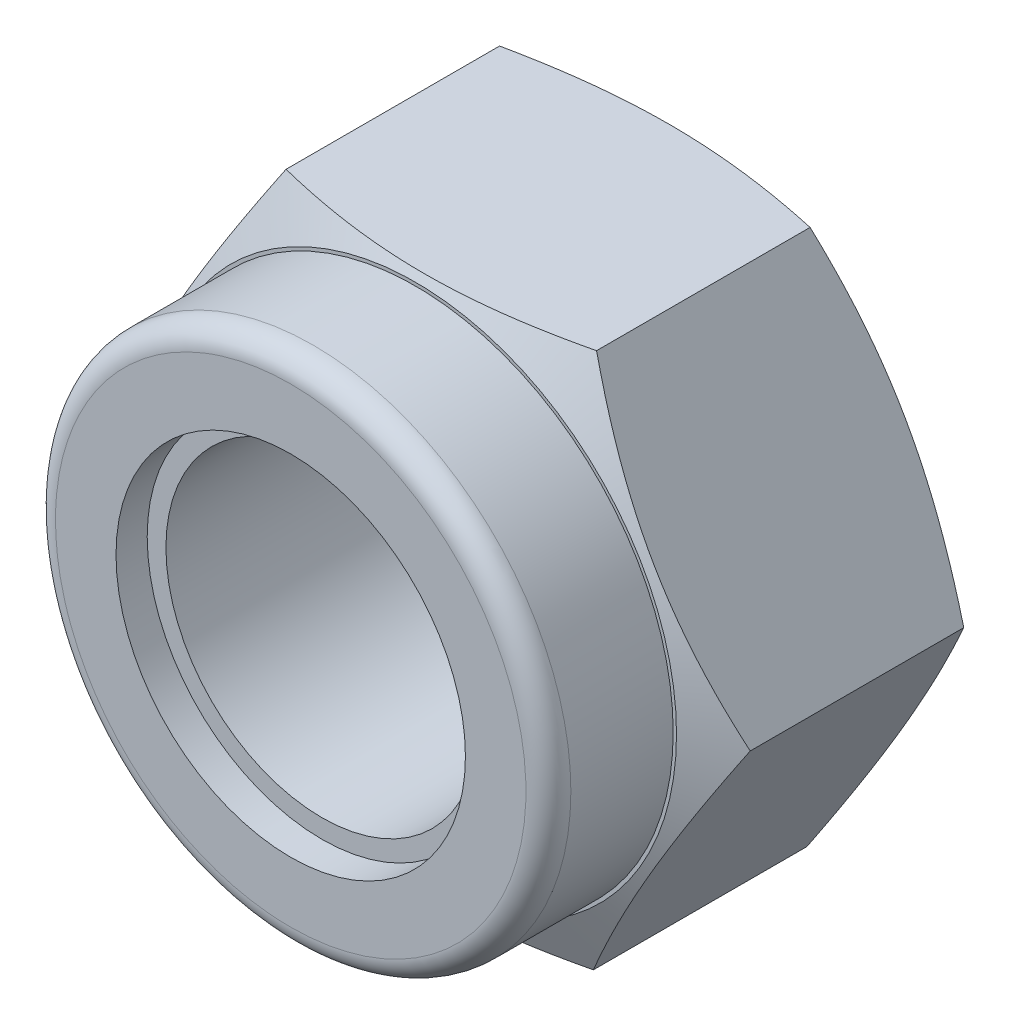
ISO-10303-21;
HEADER;
FILE_DESCRIPTION(('STEP AP214'),'2;1');
FILE_NAME('part.step','',(''),(''),'','','');
FILE_SCHEMA(('AUTOMOTIVE_DESIGN { 1 0 10303 214 1 1 1 1 }'));
ENDSEC;
DATA;
#1=APPLICATION_CONTEXT('core data for automotive mechanical design processes');
#2=APPLICATION_PROTOCOL_DEFINITION('international standard','automotive_design',2000,#1);
#3=PRODUCT_CONTEXT('',#1,'mechanical');
#4=PRODUCT('Part','Part','',(#3));
#5=PRODUCT_RELATED_PRODUCT_CATEGORY('part','',(#4));
#6=PRODUCT_DEFINITION_FORMATION('','',#4);
#7=PRODUCT_DEFINITION_CONTEXT('part definition',#1,'design');
#8=PRODUCT_DEFINITION('design','',#6,#7);
#9=PRODUCT_DEFINITION_SHAPE('','',#8);
#10=(LENGTH_UNIT() NAMED_UNIT(*) SI_UNIT(.MILLI.,.METRE.));
#11=(NAMED_UNIT(*) PLANE_ANGLE_UNIT() SI_UNIT($,.RADIAN.));
#12=(NAMED_UNIT(*) SI_UNIT($,.STERADIAN.) SOLID_ANGLE_UNIT());
#13=UNCERTAINTY_MEASURE_WITH_UNIT(LENGTH_MEASURE(1.E-05),#10,'distance_accuracy_value','');
#14=(GEOMETRIC_REPRESENTATION_CONTEXT(3) GLOBAL_UNCERTAINTY_ASSIGNED_CONTEXT((#13)) GLOBAL_UNIT_ASSIGNED_CONTEXT((#10,
#11,#12)) REPRESENTATION_CONTEXT('',''));
#15=CARTESIAN_POINT('',(0.,0.,0.));
#16=DIRECTION('',(0.,0.,1.));
#17=DIRECTION('',(1.,0.,0.));
#18=AXIS2_PLACEMENT_3D('',#15,#16,#17);
#19=CARTESIAN_POINT('',(0.,0.,5.334));
#20=DIRECTION('',(0.,0.,1.));
#21=DIRECTION('',(1.,0.,0.));
#22=AXIS2_PLACEMENT_3D('',#19,#20,#21);
#23=PLANE('',#22);
#24=CARTESIAN_POINT('',(0.,0.,5.33400000000736));
#25=DIRECTION('',(0.,0.,-1.));
#26=DIRECTION('',(-1.,0.,0.));
#27=AXIS2_PLACEMENT_3D('',#24,#25,#26);
#28=CIRCLE('',#27,5.31273775635555);
#29=CARTESIAN_POINT('',(-5.31273775635555,0.,5.33400000000736));
#30=VERTEX_POINT('',#29);
#31=EDGE_CURVE('E293',#30,#30,#28,.T.);
#32=ORIENTED_EDGE('',*,*,#31,.F.);
#33=EDGE_LOOP('',(#32));
#34=FACE_BOUND('',#33,.T.);
#35=CARTESIAN_POINT('',(0.,0.,5.334));
#36=DIRECTION('',(0.,0.,1.));
#37=DIRECTION('',(1.,0.,0.));
#38=AXIS2_PLACEMENT_3D('',#35,#36,#37);
#39=CIRCLE('',#38,5.2451);
#40=CARTESIAN_POINT('',(5.2451,0.,5.334));
#41=VERTEX_POINT('',#40);
#42=EDGE_CURVE('E20',#41,#41,#39,.T.);
#43=ORIENTED_EDGE('',*,*,#42,.F.);
#44=EDGE_LOOP('',(#43));
#45=FACE_BOUND('',#44,.T.);
#46=ADVANCED_FACE('F16',(#34,#45),#23,.T.);
#47=CARTESIAN_POINT('',(0.,0.,5.334));
#48=DIRECTION('',(0.,0.,1.));
#49=DIRECTION('',(1.,0.,0.));
#50=AXIS2_PLACEMENT_3D('',#47,#48,#49);
#51=CYLINDRICAL_SURFACE('',#50,5.2451);
#52=ORIENTED_EDGE('',*,*,#42,.T.);
#53=EDGE_LOOP('',(#52));
#54=FACE_BOUND('',#53,.T.);
#55=CARTESIAN_POINT('',(0.,0.,7.4168));
#56=DIRECTION('',(0.,0.,1.));
#57=DIRECTION('',(1.,0.,0.));
#58=AXIS2_PLACEMENT_3D('',#55,#56,#57);
#59=CIRCLE('',#58,5.2451);
#60=CARTESIAN_POINT('',(5.2451,0.,7.4168));
#61=VERTEX_POINT('',#60);
#62=EDGE_CURVE('E85',#61,#61,#59,.T.);
#63=ORIENTED_EDGE('',*,*,#62,.F.);
#64=EDGE_LOOP('',(#63));
#65=FACE_BOUND('',#64,.T.);
#66=ADVANCED_FACE('F121',(#54,#65),#51,.T.);
#67=CARTESIAN_POINT('',(0.,0.,4.83836780344404));
#68=DIRECTION('',(0.,0.,-1.));
#69=DIRECTION('',(-1.,0.,0.));
#70=AXIS2_PLACEMENT_3D('',#67,#68,#69);
#71=CONICAL_SURFACE('',#70,6.3265308160112,1.11607702485432);
#72=CARTESIAN_POINT('',(6.32037506594794,-0.0371655629206129,4.84132386008899));
#73=CARTESIAN_POINT('',(6.22833366151809,-0.19444286281713,4.8858660135372));
#74=CARTESIAN_POINT('',(6.13593989417938,-0.352322268768321,4.92769627799901));
#75=CARTESIAN_POINT('',(5.95043037166558,-0.669314789545201,5.00501655106751));
#76=CARTESIAN_POINT('',(5.85731426499188,-0.828428505000025,5.04050324073664));
#77=CARTESIAN_POINT('',(5.67031652629657,-1.14796404024023,5.10421314817306));
#78=CARTESIAN_POINT('',(5.57643405141017,-1.30838730028498,5.1324267923882));
#79=CARTESIAN_POINT('',(5.38814286869859,-1.63013302977098,5.18062149325364));
#80=CARTESIAN_POINT('',(5.29373425705883,-1.79145533485376,5.20060400767163));
#81=CARTESIAN_POINT('',(5.10662322282933,-2.11118446574603,5.23126731054475));
#82=CARTESIAN_POINT('',(5.01392905247022,-2.26957719041745,5.24214339050006));
#83=CARTESIAN_POINT('',(4.82837594477426,-2.58664418810835,5.25490604687276));
#84=CARTESIAN_POINT('',(4.73551699905818,-2.74531847544599,5.25679215221227));
#85=CARTESIAN_POINT('',(4.54996186341723,-3.06238893842205,5.25150045578435));
#86=CARTESIAN_POINT('',(4.4572656043928,-3.2207852321355,5.24433199570822));
#87=CARTESIAN_POINT('',(4.27216288236742,-3.53708262572682,5.22123078858181));
#88=CARTESIAN_POINT('',(4.17975639476994,-3.69498376763441,5.20529880682979));
#89=CARTESIAN_POINT('',(4.00714250371091,-3.98994066098654,5.16780955551947));
#90=CARTESIAN_POINT('',(3.92688014289494,-4.12709032173596,5.14722700506324));
#91=CARTESIAN_POINT('',(3.76677978044193,-4.40066451234116,5.10035283174324));
#92=CARTESIAN_POINT('',(3.68694180089308,-4.53708900445337,5.0740609146422));
#93=CARTESIAN_POINT('',(3.5269404443261,-4.81049401708344,5.01605322972002));
#94=CARTESIAN_POINT('',(3.44678193376816,-4.94746622195552,4.9842853299852));
#95=CARTESIAN_POINT('',(3.28699660715654,-5.22050208976119,4.91612438552128));
#96=CARTESIAN_POINT('',(3.20736961164292,-5.35656605935,4.87973299465746));
#97=CARTESIAN_POINT('',(3.12800121134054,-5.49218815001656,4.84132386008874));
#98=B_SPLINE_CURVE_WITH_KNOTS('',3,(#72,#73,#74,#75,#76,#77,#78,#79,#80,#81,#82,#83,#84,#85,#86,
#87,#88,#89,#90,#91,#92,#93,#94,#95,#96,#97),.UNSPECIFIED.,.F.,.F.,(4,2,2,2,2,2,2,2,2,2,2,2,4),
(0.,0.562813868194877,1.12592134237628,1.68976629638556,2.2535113481042,2.80483224896724,
3.35618203892448,3.90696345979255,4.45769678981567,4.93829687717906,5.41892173857439,
5.90440415872453,6.38971340373801),.UNSPECIFIED.);
#99=CARTESIAN_POINT('',(6.3203750659453,-0.0371655629146358,4.8413238600903));
#100=VERTEX_POINT('',#99);
#101=CARTESIAN_POINT('',(3.12800122281629,-5.49218815008425,4.84132385728342));
#102=VERTEX_POINT('',#101);
#103=EDGE_CURVE('E73',#100,#102,#98,.T.);
#104=ORIENTED_EDGE('',*,*,#103,.F.);
#105=CARTESIAN_POINT('',(3.19237385460845,5.45502258709762,4.84132386008864));
#106=CARTESIAN_POINT('',(3.28208512918141,5.29750628008782,4.88563179788484));
#107=CARTESIAN_POINT('',(3.37213784296513,5.13939046935004,4.92725624998518));
#108=CARTESIAN_POINT('',(3.55294266570987,4.82193084006841,5.00423596484944));
#109=CARTESIAN_POINT('',(3.64369510847837,4.66258643542072,5.0395880139036));
#110=CARTESIAN_POINT('',(3.8259485291596,4.34258333768004,5.10311689041716));
#111=CARTESIAN_POINT('',(3.91745035997898,4.18192314704165,5.13128385422299));
#112=CARTESIAN_POINT('',(4.1009666015464,3.85970277077768,5.17948424190754));
#113=CARTESIAN_POINT('',(4.19298092192724,3.69814274382008,5.19951905640176));
#114=CARTESIAN_POINT('',(4.3763064177163,3.3762572816539,5.23055252558859));
#115=CARTESIAN_POINT('',(4.46761329058068,3.21593940091178,5.24165376667182));
#116=CARTESIAN_POINT('',(4.65039373436749,2.89501094865245,5.25477402327016));
#117=CARTESIAN_POINT('',(4.74186731391235,2.73440036199585,5.25679255485539));
#118=CARTESIAN_POINT('',(4.92465602509764,2.41345739372297,5.25166678488675));
#119=CARTESIAN_POINT('',(5.01597122281918,2.25312489608054,5.24453194191376));
#120=CARTESIAN_POINT('',(5.19831553759308,1.93296220522435,5.2214010893566));
#121=CARTESIAN_POINT('',(5.2893446796386,1.77313196812721,5.20540587686116));
#122=CARTESIAN_POINT('',(5.45755507746106,1.47778580576614,5.16812128791714));
#123=CARTESIAN_POINT('',(5.53479875100708,1.34216028651277,5.14796055986878));
#124=CARTESIAN_POINT('',(5.68888070460646,1.07162104355403,5.10212452056477));
#125=CARTESIAN_POINT('',(5.76571899315048,0.936707304940669,5.07644932528127));
#126=CARTESIAN_POINT('',(5.91894129525481,0.667677450065663,5.02012897810935));
#127=CARTESIAN_POINT('',(5.99532532753603,0.533561300933592,4.98948403252753));
#128=CARTESIAN_POINT('',(6.14762095713527,0.266158510566403,4.9237807036753));
#129=CARTESIAN_POINT('',(6.22353258486393,0.13287181593588,4.88872260764732));
#130=CARTESIAN_POINT('',(6.30626569398043,-0.0123921308479018,4.84827518686258));
#131=CARTESIAN_POINT('',(6.31332140864244,-0.0247806530505442,4.84480784669621));
#132=CARTESIAN_POINT('',(6.32037506594266,-0.0371655629086588,4.84132386009161));
#133=B_SPLINE_CURVE_WITH_KNOTS('',3,(#105,#106,#107,#108,#109,#110,#111,#112,#113,#114,#115,
#116,#117,#118,#119,#120,#121,#122,#123,#124,#125,#126,#127,#128,#129,#130,#131,#132),
.UNSPECIFIED.,.F.,.F.,(4,2,2,2,2,2,2,2,2,2,2,2,2,4),(0.,0.55985412939021,1.11999428081796,
1.68089930141867,2.24170836557184,2.79598175912566,3.35028468420697,3.90401528500992,
4.45769607967872,4.92972204239881,5.4017380791355,5.87373452633379,6.34570026817044,
6.38971758818025),.UNSPECIFIED.);
#134=CARTESIAN_POINT('',(3.19237385707062,5.45502258277493,4.8413238613046));
#135=VERTEX_POINT('',#134);
#136=EDGE_CURVE('E129',#135,#100,#133,.T.);
#137=ORIENTED_EDGE('',*,*,#136,.F.);
#138=CARTESIAN_POINT('',(-3.12800121134198,5.49218815001699,4.84132386008821));
#139=CARTESIAN_POINT('',(-2.94577437197797,5.49111660552899,4.88586601353647));
#140=CARTESIAN_POINT('',(-2.76284991202042,5.49004095883792,4.92769627799833));
#141=CARTESIAN_POINT('',(-2.39557157496093,5.48788126008548,5.00501655106693));
#142=CARTESIAN_POINT('',(-2.21121700194961,5.48679720393198,5.04050324073611));
#143=CARTESIAN_POINT('',(-1.84099224167192,5.48462017939169,5.10421314817263));
#144=CARTESIAN_POINT('',(-1.65512038567198,5.48352720119229,5.13242679238782));
#145=CARTESIAN_POINT('',(-1.28233481902201,5.48133511839845,5.18062149325336));
#146=CARTESIAN_POINT('',(-1.09542129880329,5.48023601492378,5.2006040076714));
#147=CARTESIAN_POINT('',(-0.724972232005771,5.47805767139879,5.2312673105446));
#148=CARTESIAN_POINT('',(-0.541453023486053,5.47697852742078,5.24214339049995));
#149=CARTESIAN_POINT('',(-0.174088394935942,5.47481832125039,5.25490604687272));
#150=CARTESIAN_POINT('',(0.00975704168396752,5.47373725896044,5.25679215221226));
#151=CARTESIAN_POINT('',(0.37712568523155,5.47157702918074,5.25150045578441));
#152=CARTESIAN_POINT('',(0.560649028964985,5.47049786088653,5.2443319957083));
#153=CARTESIAN_POINT('',(0.927121967978725,5.46834289809856,5.22123078858194));
#154=CARTESIAN_POINT('',(1.11007161195609,5.46726710331844,5.20529880682994));
#155=CARTESIAN_POINT('',(1.45181872015016,5.4652575352913,5.16780955551962));
#156=CARTESIAN_POINT('',(1.61072499088775,5.46432312223167,5.14722700506338));
#157=CARTESIAN_POINT('',(1.92769737099852,5.46245923649487,5.10035283174334));
#158=CARTESIAN_POINT('',(2.08576343664071,5.46152976407484,5.07406091464228));
#159=CARTESIAN_POINT('',(2.40253980138424,5.4596670309629,5.01605322972003));
#160=CARTESIAN_POINT('',(2.56124046569499,5.45873382692624,4.98428532998516));
#161=CARTESIAN_POINT('',(2.87758912666524,5.45687360883142,4.91612438552116));
#162=CARTESIAN_POINT('',(3.0352374786259,5.45594659268399,4.87973299465728));
#163=CARTESIAN_POINT('',(3.19237385460888,5.45502258709768,4.8413238600885));
#164=B_SPLINE_CURVE_WITH_KNOTS('',3,(#138,#139,#140,#141,#142,#143,#144,#145,#146,#147,#148,
#149,#150,#151,#152,#153,#154,#155,#156,#157,#158,#159,#160,#161,#162,#163),.UNSPECIFIED.,.F.,
.F.,(4,2,2,2,2,2,2,2,2,2,2,2,4),(0.,0.56281386819512,1.12592134237677,1.68976629638629,
2.25351134810518,2.80483224896845,3.35618203892592,3.90696345979422,4.45769678981757,
4.93829687718154,5.41892173857746,5.90440415872821,6.3897134037423),.UNSPECIFIED.);
#165=CARTESIAN_POINT('',(-3.12800122281598,5.49218815008425,4.84132385728349));
#166=VERTEX_POINT('',#165);
#167=EDGE_CURVE('E137',#166,#135,#164,.T.);
#168=ORIENTED_EDGE('',*,*,#167,.F.);
#169=CARTESIAN_POINT('',(-6.32037506594956,0.0371655629178402,4.84132386008821));
#170=CARTESIAN_POINT('',(-6.22833366151967,0.194442862814418,4.88586601353647));
#171=CARTESIAN_POINT('',(-6.13593989418093,0.352322268765671,4.92769627799833));
#172=CARTESIAN_POINT('',(-5.95043037166705,0.669314789542675,5.00501655106693));
#173=CARTESIAN_POINT('',(-5.85731426499332,0.828428504997562,5.04050324073611));
#174=CARTESIAN_POINT('',(-5.67031652629793,1.1479640402379,5.10421314817263));
#175=CARTESIAN_POINT('',(-5.5764340514115,1.30838730028271,5.13242679238782));
#176=CARTESIAN_POINT('',(-5.38814286869984,1.63013302976884,5.18062149325336));
#177=CARTESIAN_POINT('',(-5.29373425706004,1.79145533485169,5.2006040076714));
#178=CARTESIAN_POINT('',(-5.10662322283046,2.11118446574409,5.2312673105446));
#179=CARTESIAN_POINT('',(-5.01392905247131,2.26957719041558,5.24214339049995));
#180=CARTESIAN_POINT('',(-4.82837594477528,2.58664418810661,5.25490604687272));
#181=CARTESIAN_POINT('',(-4.73551699905915,2.74531847544432,5.25679215221226));
#182=CARTESIAN_POINT('',(-4.54996186341813,3.0623889384205,5.25150045578441));
#183=CARTESIAN_POINT('',(-4.45726560439367,3.22078523213402,5.2443319957083));
#184=CARTESIAN_POINT('',(-4.27216288236821,3.53708262572548,5.22123078858194));
#185=CARTESIAN_POINT('',(-4.17975639477069,3.69498376763314,5.20529880682994));
#186=CARTESIAN_POINT('',(-4.00714250371156,3.98994066098543,5.16780955551963));
#187=CARTESIAN_POINT('',(-3.92688014289553,4.12709032173495,5.1472270050634));
#188=CARTESIAN_POINT('',(-3.7667797804424,4.40066451234036,5.10035283174339));
#189=CARTESIAN_POINT('',(-3.68694180089349,4.53708900445266,5.07406091464234));
#190=CARTESIAN_POINT('',(-3.5269404443264,4.81049401708294,5.01605322972014));
#191=CARTESIAN_POINT('',(-3.44678193376839,4.94746622195512,4.98428532998529));
#192=CARTESIAN_POINT('',(-3.28699660715666,5.22050208976099,4.91612438552134));
#193=CARTESIAN_POINT('',(-3.20736961164298,5.3565660593499,4.87973299465749));
#194=CARTESIAN_POINT('',(-3.12800121134054,5.49218815001656,4.84132386008874));
#195=B_SPLINE_CURVE_WITH_KNOTS('',3,(#169,#170,#171,#172,#173,#174,#175,#176,#177,#178,#179,
#180,#181,#182,#183,#184,#185,#186,#187,#188,#189,#190,#191,#192,#193,#194),.UNSPECIFIED.,.F.,
.F.,(4,2,2,2,2,2,2,2,2,2,2,2,4),(0.,0.56281386819512,1.12592134237677,1.6897662963863,
2.25351134810518,2.80483224896845,3.35618203892592,3.90696345979422,4.45769678981757,
4.9382968771813,5.41892173857698,5.90440415872747,6.38971340374132),.UNSPECIFIED.);
#196=CARTESIAN_POINT('',(-6.32037507174721,0.0371655530104973,4.84132385728233));
#197=VERTEX_POINT('',#196);
#198=EDGE_CURVE('E145',#197,#166,#195,.T.);
#199=ORIENTED_EDGE('',*,*,#198,.F.);
#200=CARTESIAN_POINT('',(-3.19237385460758,-5.45502258709915,4.84132386008821));
#201=CARTESIAN_POINT('',(-3.28208512918056,-5.29750628008931,4.88563179788444));
#202=CARTESIAN_POINT('',(-3.3721378429643,-5.13939046935149,4.92725624998481));
#203=CARTESIAN_POINT('',(-3.55294266570909,-4.82193084006978,5.00423596484913));
#204=CARTESIAN_POINT('',(-3.64369510847761,-4.66258643542207,5.03958801390332));
#205=CARTESIAN_POINT('',(-3.82594852915888,-4.34258333768131,5.10311689041693));
#206=CARTESIAN_POINT('',(-3.91745035997828,-4.18192314704288,5.13128385422278));
#207=CARTESIAN_POINT('',(-4.10096660154574,-3.85970277077883,5.17948424190739));
#208=CARTESIAN_POINT('',(-4.19298092192661,-3.69814274382119,5.19951905640164));
#209=CARTESIAN_POINT('',(-4.3763064177157,-3.37625728165494,5.23055252558851));
#210=CARTESIAN_POINT('',(-4.4676132905801,-3.21593940091279,5.24165376667176));
#211=CARTESIAN_POINT('',(-4.65039373436695,-2.89501094865339,5.25477402327014));
#212=CARTESIAN_POINT('',(-4.74186731391183,-2.73440036199675,5.25679255485539));
#213=CARTESIAN_POINT('',(-4.92465602509716,-2.41345739372381,5.25166678488678));
#214=CARTESIAN_POINT('',(-5.01597122281873,-2.25312489608134,5.2445319419138));
#215=CARTESIAN_POINT('',(-5.19831553759266,-1.93296220522508,5.22140108935667));
#216=CARTESIAN_POINT('',(-5.28934467963821,-1.77313196812791,5.20540587686124));
#217=CARTESIAN_POINT('',(-5.45755507746104,-1.47778580576617,5.16812128791715));
#218=CARTESIAN_POINT('',(-5.53479875100741,-1.34216028651217,5.1479605598687));
#219=CARTESIAN_POINT('',(-5.68888070460751,-1.0716210435522,5.10212452056444));
#220=CARTESIAN_POINT('',(-5.76571899315188,-0.936707304938216,5.07644932528079));
#221=CARTESIAN_POINT('',(-5.91894129525691,-0.667677450061981,5.02012897810854));
#222=CARTESIAN_POINT('',(-5.99532532753847,-0.5335613009293,4.98948403252653));
#223=CARTESIAN_POINT('',(-6.14762095713841,-0.266158510560896,4.92378070367389));
#224=CARTESIAN_POINT('',(-6.2235325848674,-0.132871815929769,4.88872260764569));
#225=CARTESIAN_POINT('',(-6.3062656939849,0.0123921308557474,4.84827518686039));
#226=CARTESIAN_POINT('',(-6.31332140864756,0.0247806530595255,4.84480784669369));
#227=CARTESIAN_POINT('',(-6.32037506594842,0.0371655629187751,4.84132386008877));
#228=B_SPLINE_CURVE_WITH_KNOTS('',3,(#200,#201,#202,#203,#204,#205,#206,#207,#208,#209,#210,
#211,#212,#213,#214,#215,#216,#217,#218,#219,#220,#221,#222,#223,#224,#225,#226,#227),
.UNSPECIFIED.,.F.,.F.,(4,2,2,2,2,2,2,2,2,2,2,2,2,4),(0.,0.559854129390351,1.11999428081824,
1.6808993014191,2.24170836557241,2.79598175912635,3.35028468420777,3.90401528501084,
4.45769607967976,4.92972204240202,5.40173807914089,5.87373452634136,6.34570026818019,
6.38971758819405),.UNSPECIFIED.);
#229=CARTESIAN_POINT('',(-3.19237384892808,-5.45502259707088,4.84132385728312));
#230=VERTEX_POINT('',#229);
#231=EDGE_CURVE('E93',#230,#197,#228,.T.);
#232=ORIENTED_EDGE('',*,*,#231,.F.);
#233=CARTESIAN_POINT('',(3.12800121134198,-5.49218815001699,4.84132386008821));
#234=CARTESIAN_POINT('',(2.94577437197798,-5.491116605529,4.88586601353647));
#235=CARTESIAN_POINT('',(2.76284991202042,-5.49004095883792,4.92769627799833));
#236=CARTESIAN_POINT('',(2.39557157496093,-5.48788126008548,5.00501655106693));
#237=CARTESIAN_POINT('',(2.21121700194961,-5.48679720393198,5.04050324073611));
#238=CARTESIAN_POINT('',(1.84099224167193,-5.48462017939169,5.10421314817263));
#239=CARTESIAN_POINT('',(1.65512038567198,-5.4835272011923,5.13242679238782));
#240=CARTESIAN_POINT('',(1.28233481902201,-5.48133511839845,5.18062149325336));
#241=CARTESIAN_POINT('',(1.09542129880329,-5.48023601492378,5.20060400767139));
#242=CARTESIAN_POINT('',(0.724972232005771,-5.47805767139879,5.2312673105446));
#243=CARTESIAN_POINT('',(0.541453023486052,-5.47697852742079,5.24214339049995));
#244=CARTESIAN_POINT('',(0.17408839493594,-5.47481832125039,5.25490604687272));
#245=CARTESIAN_POINT('',(-0.0097570416839691,-5.47373725896044,5.25679215221226));
#246=CARTESIAN_POINT('',(-0.377125685231552,-5.47157702918074,5.25150045578441));
#247=CARTESIAN_POINT('',(-0.560649028964987,-5.47049786088653,5.2443319957083));
#248=CARTESIAN_POINT('',(-0.927121967978728,-5.46834289809856,5.22123078858194));
#249=CARTESIAN_POINT('',(-1.11007161195609,-5.46726710331844,5.20529880682994));
#250=CARTESIAN_POINT('',(-1.45181872015008,-5.4652575352913,5.16780955551963));
#251=CARTESIAN_POINT('',(-1.6107249908876,-5.46432312223168,5.1472270050634));
#252=CARTESIAN_POINT('',(-1.92769737099821,-5.46245923649487,5.10035283174339));
#253=CARTESIAN_POINT('',(-2.08576343664031,-5.46152976407484,5.07406091464234));
#254=CARTESIAN_POINT('',(-2.40253980138368,-5.45966703096291,5.01605322972014));
#255=CARTESIAN_POINT('',(-2.56124046569435,-5.45873382692624,4.98428532998529));
#256=CARTESIAN_POINT('',(-2.87758912666444,-5.45687360883142,4.91612438552134));
#257=CARTESIAN_POINT('',(-3.03523747862502,-5.455946592684,4.87973299465749));
#258=CARTESIAN_POINT('',(-3.19237385460793,-5.45502258709769,4.84132386008874));
#259=B_SPLINE_CURVE_WITH_KNOTS('',3,(#233,#234,#235,#236,#237,#238,#239,#240,#241,#242,#243,
#244,#245,#246,#247,#248,#249,#250,#251,#252,#253,#254,#255,#256,#257,#258),.UNSPECIFIED.,.F.,
.F.,(4,2,2,2,2,2,2,2,2,2,2,2,4),(0.,0.56281386819512,1.12592134237677,1.68976629638629,
2.25351134810518,2.80483224896845,3.35618203892592,3.90696345979422,4.45769678981757,
4.9382968771813,5.41892173857698,5.90440415872747,6.38971340374131),.UNSPECIFIED.);
#260=EDGE_CURVE('E84',#102,#230,#259,.T.);
#261=ORIENTED_EDGE('',*,*,#260,.F.);
#262=EDGE_LOOP('',(#104,#137,#168,#199,#232,#261));
#263=FACE_BOUND('',#262,.T.);
#264=ORIENTED_EDGE('',*,*,#31,.T.);
#265=EDGE_LOOP('',(#264));
#266=FACE_BOUND('',#265,.T.);
#267=ADVANCED_FACE('F95',(#263,#266),#71,.T.);
#268=CARTESIAN_POINT('',(0.,0.,7.4168));
#269=DIRECTION('',(0.,0.,-1.));
#270=DIRECTION('',(-1.,0.,0.));
#271=AXIS2_PLACEMENT_3D('',#268,#269,#270);
#272=TOROIDAL_SURFACE('',#271,4.7879,0.4572);
#273=ORIENTED_EDGE('',*,*,#62,.T.);
#274=EDGE_LOOP('',(#273));
#275=FACE_BOUND('',#274,.T.);
#276=CARTESIAN_POINT('',(0.,4.7879,7.874));
#277=CARTESIAN_POINT('',(-0.912507970637655,4.78800107826667,7.874));
#278=CARTESIAN_POINT('',(-1.7624006599113,4.45173340665681,7.874));
#279=CARTESIAN_POINT('',(-2.21282144880202,4.27352037831036,7.874));
#280=CARTESIAN_POINT('',(-2.61998557823273,4.00745080816378,7.874));
#281=CARTESIAN_POINT('',(-3.03415135893962,3.73680586850226,7.874));
#282=CARTESIAN_POINT('',(-3.38555655764307,3.38555655764307,7.874));
#283=CARTESIAN_POINT('',(-3.73546696528567,3.03580137473629,7.874));
#284=CARTESIAN_POINT('',(-4.00745080816377,2.61998557823273,7.874));
#285=CARTESIAN_POINT('',(-4.27255727958396,2.21468408162421,7.874));
#286=CARTESIAN_POINT('',(-4.4517334066568,1.7624006599113,7.874));
#287=CARTESIAN_POINT('',(-4.78770071533789,0.9143387755723,7.874));
#288=CARTESIAN_POINT('',(-4.7879,0.,7.874));
#289=CARTESIAN_POINT('',(-4.78809883178006,-0.912260905566992,7.874));
#290=CARTESIAN_POINT('',(-4.4517334066568,-1.7624006599113,7.874));
#291=CARTESIAN_POINT('',(-4.27352037830815,-2.21282144880707,7.874));
#292=CARTESIAN_POINT('',(-4.00745080816377,-2.61998557823274,7.874));
#293=CARTESIAN_POINT('',(-3.7368058684979,-3.03415135894459,7.874));
#294=CARTESIAN_POINT('',(-3.38555655764306,-3.38555655764308,7.874));
#295=CARTESIAN_POINT('',(-3.03580137473736,-3.73546696528398,7.874));
#296=CARTESIAN_POINT('',(-2.61998557823271,-4.00745080816379,7.874));
#297=CARTESIAN_POINT('',(-2.214684081631,-4.27255727958048,7.874));
#298=CARTESIAN_POINT('',(-1.76240065991129,-4.45173340665681,7.874));
#299=CARTESIAN_POINT('',(-0.914091321852844,-4.78779874634594,7.874));
#300=CARTESIAN_POINT('',(0.,-4.7879,7.874));
#301=B_SPLINE_CURVE_WITH_KNOTS('',2,(#276,#277,#278,#279,#280,#281,#282,#283,#284,#285,#286,
#287,#288,#289,#290,#291,#292,#293,#294,#295,#296,#297,#298,#299,#300),.UNSPECIFIED.,.F.,.F.,(3,
2,2,2,2,2,2,2,2,2,2,2,3),(0.,0.125,0.1875,0.25,0.3125,0.375,0.5,0.625,0.6875,0.75,0.8125,0.875,
1.),.UNSPECIFIED.);
#302=CARTESIAN_POINT('',(0.,4.7879,7.874));
#303=VERTEX_POINT('',#302);
#304=CARTESIAN_POINT('',(0.,-4.7879,7.874));
#305=VERTEX_POINT('',#304);
#306=EDGE_CURVE('E273',#303,#305,#301,.T.);
#307=ORIENTED_EDGE('',*,*,#306,.F.);
#308=CARTESIAN_POINT('',(0.,0.,7.874));
#309=DIRECTION('',(0.,0.,-1.));
#310=DIRECTION('',(-1.,0.,0.));
#311=AXIS2_PLACEMENT_3D('',#308,#309,#310);
#312=CIRCLE('',#311,4.7879);
#313=EDGE_CURVE('E274',#305,#303,#312,.F.);
#314=ORIENTED_EDGE('',*,*,#313,.F.);
#315=EDGE_LOOP('',(#307,#314));
#316=FACE_BOUND('',#315,.T.);
#317=ADVANCED_FACE('F18',(#275,#316),#272,.T.);
#318=CARTESIAN_POINT('',(6.32037506594871,-0.0371655629192953,0.));
#319=DIRECTION('',(0.863070343395602,-0.505083737959358,0.));
#320=DIRECTION('',(0.505083737959358,0.863070343395602,0.));
#321=AXIS2_PLACEMENT_3D('',#318,#319,#320);
#322=PLANE('',#321);
#323=CARTESIAN_POINT('',(6.32037502985006,-0.0371654459643939,0.49495993962358));
#324=CARTESIAN_POINT('',(6.21595254922659,-0.215599232787237,0.450368281543948));
#325=CARTESIAN_POINT('',(6.11116742702291,-0.394652622018415,0.408901016145712));
#326=CARTESIAN_POINT('',(5.90086249945405,-0.754014743171803,0.333349470541661));
#327=CARTESIAN_POINT('',(5.79534231202103,-0.934324127925177,0.299269380046743));
#328=CARTESIAN_POINT('',(5.5836463007788,-1.29606324310159,0.239671060506125));
#329=CARTESIAN_POINT('',(5.47747030068677,-1.47749327475536,0.214155245517185));
#330=CARTESIAN_POINT('',(5.26465625223767,-1.84114286653184,0.172749422188399));
#331=CARTESIAN_POINT('',(5.1580183031682,-2.02336225699609,0.156857439621324));
#332=CARTESIAN_POINT('',(4.9464654976336,-2.38485667558204,0.135632320851297));
#333=CARTESIAN_POINT('',(4.84155560760613,-2.56412321719835,0.130107740976537));
#334=CARTESIAN_POINT('',(4.6317176050926,-2.9226874380652,0.129300758661452));
#335=CARTESIAN_POINT('',(4.52678949183353,-3.10198511863662,0.13401911056459));
#336=CARTESIAN_POINT('',(4.31725526842711,-3.46003025161962,0.153463378695621));
#337=CARTESIAN_POINT('',(4.21264897279512,-3.63877802098118,0.168181601635434));
#338=CARTESIAN_POINT('',(4.00389207635088,-3.99549488348476,0.206949810762892));
#339=CARTESIAN_POINT('',(3.89974143292936,-4.1734640494361,0.230998904680507));
#340=CARTESIAN_POINT('',(3.74000861238008,-4.44641019662172,0.274420805207881));
#341=CARTESIAN_POINT('',(3.68421435964086,-4.54174956562599,0.290822311011308));
#342=CARTESIAN_POINT('',(3.57281346288463,-4.73210772407037,0.325876668715684));
#343=CARTESIAN_POINT('',(3.51720679518185,-4.82712655398393,0.344529224541546));
#344=CARTESIAN_POINT('',(3.40588754576298,-5.01734519616513,0.384021503684979));
#345=CARTESIAN_POINT('',(3.35017597495109,-5.11254328103321,0.404872337132735));
#346=CARTESIAN_POINT('',(3.23894418645349,-5.3026124728924,0.448508257005031));
#347=CARTESIAN_POINT('',(3.18342397536334,-5.39748356861324,0.471293409419105));
#348=CARTESIAN_POINT('',(3.12800127426777,-5.49218804248861,0.494959830355336));
#349=B_SPLINE_CURVE_WITH_KNOTS('',3,(#323,#324,#325,#326,#327,#328,#329,#330,#331,#332,#333,
#334,#335,#336,#337,#338,#339,#340,#341,#342,#343,#344,#345,#346,#347,#348),.UNSPECIFIED.,.F.,
.F.,(4,2,2,2,2,2,2,2,2,2,2,2,4),(0.,0.634532172801817,1.26942329071488,1.90449321868397,
2.53943282461717,3.16252769933765,3.78566846360438,4.40833036358988,5.03093273583368,
5.36594211654617,5.70090748222071,6.03765525293353,6.374414516459),.UNSPECIFIED.);
#350=CARTESIAN_POINT('',(6.32037501295764,-0.0371654698768281,0.494959834132793));
#351=VERTEX_POINT('',#350);
#352=CARTESIAN_POINT('',(3.1280012542799,-5.49218809632028,0.494959846266548));
#353=VERTEX_POINT('',#352);
#354=EDGE_CURVE('E196',#351,#353,#349,.T.);
#355=ORIENTED_EDGE('',*,*,#354,.F.);
#356=DIRECTION('',(0.,0.,1.));
#357=VECTOR('',#356,1.);
#358=CARTESIAN_POINT('',(6.32037506594758,-0.0371655629173,0.));
#359=LINE('',#358,#357);
#360=EDGE_CURVE('E80',#100,#351,#359,.F.);
#361=ORIENTED_EDGE('',*,*,#360,.F.);
#362=ORIENTED_EDGE('',*,*,#103,.T.);
#363=DIRECTION('',(0.,0.,1.));
#364=VECTOR('',#363,1.);
#365=CARTESIAN_POINT('',(3.12800123429203,-5.49218815015194,0.));
#366=LINE('',#365,#364);
#367=EDGE_CURVE('E77',#353,#102,#366,.T.);
#368=ORIENTED_EDGE('',*,*,#367,.F.);
#369=EDGE_LOOP('',(#355,#361,#362,#368));
#370=FACE_BOUND('',#369,.T.);
#371=ADVANCED_FACE('F76',(#370),#322,.T.);
#372=CARTESIAN_POINT('',(3.1280012113403,-5.49218815001698,0.));
#373=DIRECTION('',(-0.00588017641340522,-0.999982711613229,0.));
#374=DIRECTION('',(0.999982711613229,-0.00588017641340522,0.));
#375=AXIS2_PLACEMENT_3D('',#372,#373,#374);
#376=PLANE('',#375);
#377=CARTESIAN_POINT('',(3.12800126410636,-5.49218810135755,0.494959903583258));
#378=CARTESIAN_POINT('',(2.92126182811703,-5.49097244736428,0.450368264032376));
#379=CARTESIAN_POINT('',(2.71380448194717,-5.48975255335621,0.408901006496991));
#380=CARTESIAN_POINT('',(2.2974352910039,-5.48730419616397,0.333349467211875));
#381=CARTESIAN_POINT('',(2.08852268982816,-5.48607572852271,0.299269375173549));
#382=CARTESIAN_POINT('',(1.66939942080633,-5.48361116462506,0.239671055115595));
#383=CARTESIAN_POINT('',(1.45918840394405,-5.4823750663176,0.214155241161649));
#384=CARTESIAN_POINT('',(1.03785159459438,-5.4798974893929,0.172749419305434));
#385=CARTESIAN_POINT('',(0.826725998679609,-5.4786560119318,0.156857437172842));
#386=CARTESIAN_POINT('',(0.407886245447399,-5.47619311753625,0.135632319477446));
#387=CARTESIAN_POINT('',(0.20018192087746,-5.47497175841521,0.13010774025241));
#388=CARTESIAN_POINT('',(-0.215262805473554,-5.4725288279472,0.129300759234597));
#389=CARTESIAN_POINT('',(-0.423003208785049,-5.47130725659122,0.134019111787272));
#390=CARTESIAN_POINT('',(-0.837846502185645,-5.46886786265628,0.153463381242832));
#391=CARTESIAN_POINT('',(-1.04494975950399,-5.46765003791789,0.168181604854153));
#392=CARTESIAN_POINT('',(-1.45825407330196,-5.46521969362693,0.206949815300636));
#393=CARTESIAN_POINT('',(-1.66445521414101,-5.46400717357829,0.230998909865133));
#394=CARTESIAN_POINT('',(-1.98069991851997,-5.46214756677665,0.274420810848493));
#395=CARTESIAN_POINT('',(-2.09116335689859,-5.4614980110421,0.290822316393682));
#396=CARTESIAN_POINT('',(-2.31171879927797,-5.46020108371029,0.325876673424192));
#397=CARTESIAN_POINT('',(-2.42181085017261,-5.45955371183726,0.34452922883462));
#398=CARTESIAN_POINT('',(-2.6422046442367,-5.45825773504237,0.384021506992917));
#399=CARTESIAN_POINT('',(-2.75250438598245,-5.45760914188943,0.404872339869208));
#400=CARTESIAN_POINT('',(-2.97272502177834,-5.45631418331335,0.448508258467606));
#401=CARTESIAN_POINT('',(-3.08264590277041,-5.45566781796699,0.471293410179089));
#402=CARTESIAN_POINT('',(-3.19237373002677,-5.45502258783026,0.494959830356283));
#403=B_SPLINE_CURVE_WITH_KNOTS('',3,(#377,#378,#379,#380,#381,#382,#383,#384,#385,#386,#387,
#388,#389,#390,#391,#392,#393,#394,#395,#396,#397,#398,#399,#400,#401,#402),.UNSPECIFIED.,.F.,
.F.,(4,2,2,2,2,2,2,2,2,2,2,2,4),(0.,0.634532172385119,1.26942329037947,1.90449321903655,
2.53943282544507,3.16252770149619,3.78566846721456,4.4083303684351,5.03093274187141,
5.36594211199886,5.70090746711567,6.03765522705414,6.37441447977782),.UNSPECIFIED.);
#404=CARTESIAN_POINT('',(-3.1923737866375,-5.45502259743716,0.494959846267283));
#405=VERTEX_POINT('',#404);
#406=EDGE_CURVE('E92',#353,#405,#403,.T.);
#407=ORIENTED_EDGE('',*,*,#406,.F.);
#408=ORIENTED_EDGE('',*,*,#367,.T.);
#409=ORIENTED_EDGE('',*,*,#260,.T.);
#410=DIRECTION('',(0.,0.,1.));
#411=VECTOR('',#410,1.);
#412=CARTESIAN_POINT('',(-3.19237384324823,-5.45502260704406,0.));
#413=LINE('',#412,#411);
#414=EDGE_CURVE('E291',#405,#230,#413,.T.);
#415=ORIENTED_EDGE('',*,*,#414,.F.);
#416=EDGE_LOOP('',(#407,#408,#409,#415));
#417=FACE_BOUND('',#416,.T.);
#418=ADVANCED_FACE('F89',(#417),#376,.T.);
#419=CARTESIAN_POINT('',(-3.19237385460841,-5.45502258709769,0.));
#420=DIRECTION('',(-0.868950519809008,-0.494898973653871,0.));
#421=DIRECTION('',(0.494898973653871,-0.868950519809008,0.));
#422=AXIS2_PLACEMENT_3D('',#419,#420,#421);
#423=PLANE('',#422);
#424=CARTESIAN_POINT('',(-3.19237378608869,-5.45502260846171,0.494959903581125));
#425=CARTESIAN_POINT('',(-3.29431095817488,-5.27603996349761,0.450533858379517));
#426=CARTESIAN_POINT('',(-3.39660059519764,-5.09643841829634,0.409208989268028));
#427=CARTESIAN_POINT('',(-3.60189397842345,-4.73598145206156,0.333883437191058));
#428=CARTESIAN_POINT('',(-3.70489809154293,-4.55512538677263,0.29988685758606));
#429=CARTESIAN_POINT('',(-3.91155385066686,-4.19227631776945,0.240380894409588));
#430=CARTESIAN_POINT('',(-4.01520572209591,-4.01028291825484,0.214874654841236));
#431=CARTESIAN_POINT('',(-4.22296106586566,-3.64550318967372,0.173407688495263));
#432=CARTESIAN_POINT('',(-4.32706444324085,-3.46271702734947,0.157445043982262));
#433=CARTESIAN_POINT('',(-4.53435047366295,-3.09876132395802,0.135919089946519));
#434=CARTESIAN_POINT('',(-4.63753012710866,-2.91759704962522,0.130239533722684));
#435=CARTESIAN_POINT('',(-4.84391029342669,-2.55523187552015,0.129199944281238));
#436=CARTESIAN_POINT('',(-4.94711080728035,-2.37403097402479,0.133840679896716));
#437=CARTESIAN_POINT('',(-5.15319218758739,-2.01219041244224,0.153208661890227));
#438=CARTESIAN_POINT('',(-5.25607324443917,-1.83155041805085,0.167927788331837));
#439=CARTESIAN_POINT('',(-5.46138602701545,-1.47105937111545,0.206770820952582));
#440=CARTESIAN_POINT('',(-5.56381779576026,-1.29120824303579,0.230893805893423));
#441=CARTESIAN_POINT('',(-5.7190653442773,-1.01862243226427,0.273964940185001));
#442=CARTESIAN_POINT('',(-5.77209630081474,-0.925509939205661,0.289838994263521));
#443=CARTESIAN_POINT('',(-5.8779866121587,-0.739586253800447,0.323710386390241));
#444=CARTESIAN_POINT('',(-5.93084598497027,-0.646775029840328,0.341707493735086));
#445=CARTESIAN_POINT('',(-6.03639219271878,-0.461455526326656,0.379671579372275));
#446=CARTESIAN_POINT('',(-6.08907902165469,-0.368947257309796,0.399638625442373));
#447=CARTESIAN_POINT('',(-6.1942761469963,-0.184240677554524,0.441387129004676));
#448=CARTESIAN_POINT('',(-6.24678644408668,-0.0920423656139518,0.463168579451298));
#449=CARTESIAN_POINT('',(-6.30626524593391,0.0123913441615718,0.488826135008085));
#450=CARTESIAN_POINT('',(-6.31332095805282,0.0247798618990112,0.491885549052196));
#451=CARTESIAN_POINT('',(-6.32037505882868,0.0371655504178443,0.494959854124256));
#452=B_SPLINE_CURVE_WITH_KNOTS('',3,(#424,#425,#426,#427,#428,#429,#430,#431,#432,#433,#434,
#435,#436,#437,#438,#439,#440,#441,#442,#443,#444,#445,#446,#447,#448,#449,#450,#451),
.UNSPECIFIED.,.F.,.F.,(4,2,2,2,2,2,2,2,2,2,2,2,2,4),(0.,0.632176386040315,1.26470583507634,
1.89746925212574,2.5301054759119,3.15554422197519,3.78102956304947,4.40601155647972,
5.0309323396401,5.35588834516234,5.68080907154056,6.00574098104955,6.33067162886182,
6.37441591397069),.UNSPECIFIED.);
#453=CARTESIAN_POINT('',(-6.32037506818751,0.0371655467603267,0.494959858148727));
#454=VERTEX_POINT('',#453);
#455=EDGE_CURVE('E202',#405,#454,#452,.T.);
#456=ORIENTED_EDGE('',*,*,#455,.F.);
#457=ORIENTED_EDGE('',*,*,#414,.T.);
#458=ORIENTED_EDGE('',*,*,#231,.T.);
#459=DIRECTION('',(0.,0.,1.));
#460=VECTOR('',#459,1.);
#461=CARTESIAN_POINT('',(-6.32037507754601,0.0371655431022195,0.));
#462=LINE('',#461,#460);
#463=EDGE_CURVE('E144',#454,#197,#462,.T.);
#464=ORIENTED_EDGE('',*,*,#463,.F.);
#465=EDGE_LOOP('',(#456,#457,#458,#464));
#466=FACE_BOUND('',#465,.T.);
#467=ADVANCED_FACE('F211',(#466),#423,.T.);
#468=CARTESIAN_POINT('',(-6.32037506594871,0.0371655629192914,0.));
#469=DIRECTION('',(-0.863070343395602,0.505083737959358,0.));
#470=DIRECTION('',(-0.505083737959358,-0.863070343395602,0.));
#471=AXIS2_PLACEMENT_3D('',#468,#469,#470);
#472=PLANE('',#471);
#473=CARTESIAN_POINT('',(-6.32037507081462,0.0371655521408976,0.494959860650831));
#474=CARTESIAN_POINT('',(-6.21595253718308,0.215599316651127,0.450368242624078));
#475=CARTESIAN_POINT('',(-6.11116739330752,0.39465269659167,0.408900994276151));
#476=CARTESIAN_POINT('',(-5.90086244986322,0.754014810939815,0.333349462483797));
#477=CARTESIAN_POINT('',(-5.79534226824115,0.934324198187027,0.299269368751353));
#478=CARTESIAN_POINT('',(-5.58364626100297,1.29606331561824,0.239671048273515));
#479=CARTESIAN_POINT('',(-5.47747025910069,1.47749334703429,0.214155235604035));
#480=CARTESIAN_POINT('',(-5.26465620911973,1.84114293899256,0.172749415617394));
#481=CARTESIAN_POINT('',(-5.15801826032858,2.02336232987557,0.156857434066335));
#482=CARTESIAN_POINT('',(-4.94646545452811,2.38485674955669,0.135632317757613));
#483=CARTESIAN_POINT('',(-4.841555563965,2.56412329185591,0.130107739349354));
#484=CARTESIAN_POINT('',(-4.63171756051101,2.92268751415969,0.12930075994763));
#485=CARTESIAN_POINT('',(-4.52678944684713,3.10198519548513,0.134019113301913));
#486=CARTESIAN_POINT('',(-4.31725522270815,3.46003032976541,0.153463384373127));
#487=CARTESIAN_POINT('',(-4.21264892674821,3.63877809967057,0.168181608794519));
#488=CARTESIAN_POINT('',(-4.00389202970271,3.99549496318964,0.206949820816233));
#489=CARTESIAN_POINT('',(-3.89974138600779,4.17346412961298,0.230998916145158));
#490=CARTESIAN_POINT('',(-3.7400085691363,4.44641027051587,0.27442081765598));
#491=CARTESIAN_POINT('',(-3.6842143203297,4.54174963279977,0.290822322889906));
#492=CARTESIAN_POINT('',(-3.57281343140607,4.73210777785974,0.325876679107955));
#493=CARTESIAN_POINT('',(-3.5172067676033,4.8271266011092,0.34452923401741));
#494=CARTESIAN_POINT('',(-3.40588752603745,5.01734522987151,0.384021510987847));
#495=CARTESIAN_POINT('',(-3.35017595917824,5.11254330798536,0.404872343175146));
#496=CARTESIAN_POINT('',(-3.23894417856852,5.30261248636595,0.448508260237703));
#497=CARTESIAN_POINT('',(-3.18342397141354,5.39748357536249,0.471293411102152));
#498=CARTESIAN_POINT('',(-3.12800127423913,5.49218804253754,0.494959830364238));
#499=B_SPLINE_CURVE_WITH_KNOTS('',3,(#473,#474,#475,#476,#477,#478,#479,#480,#481,#482,#483,
#484,#485,#486,#487,#488,#489,#490,#491,#492,#493,#494,#495,#496,#497,#498),.UNSPECIFIED.,.F.,
.F.,(4,2,2,2,2,2,2,2,2,2,2,2,4),(0.,0.634532171427077,1.26942328903815,1.90449321800705,
2.53943282448176,3.1625277016178,3.78566846856102,4.40833037075881,5.03093274512327,
5.36594210248427,5.7009074448661,6.03765519181169,6.37441443151112),.UNSPECIFIED.);
#500=CARTESIAN_POINT('',(-3.12800125426528,5.49218809634474,0.49495984626927));
#501=VERTEX_POINT('',#500);
#502=EDGE_CURVE('E170',#454,#501,#499,.T.);
#503=ORIENTED_EDGE('',*,*,#502,.F.);
#504=ORIENTED_EDGE('',*,*,#463,.T.);
#505=ORIENTED_EDGE('',*,*,#198,.T.);
#506=DIRECTION('',(0.,0.,1.));
#507=VECTOR('',#506,1.);
#508=CARTESIAN_POINT('',(-3.12800123429142,5.49218815015194,0.));
#509=LINE('',#508,#507);
#510=EDGE_CURVE('E143',#501,#166,#509,.T.);
#511=ORIENTED_EDGE('',*,*,#510,.F.);
#512=EDGE_LOOP('',(#503,#504,#505,#511));
#513=FACE_BOUND('',#512,.T.);
#514=ADVANCED_FACE('F155',(#513),#472,.T.);
#515=CARTESIAN_POINT('',(-3.1280012113403,5.49218815001698,0.));
#516=DIRECTION('',(0.00588017641340505,0.999982711613229,0.));
#517=DIRECTION('',(-0.999982711613229,0.00588017641340505,0.));
#518=AXIS2_PLACEMENT_3D('',#515,#516,#517);
#519=PLANE('',#518);
#520=CARTESIAN_POINT('',(-3.12800126410553,5.49218810138533,0.494959903559902));
#521=CARTESIAN_POINT('',(-2.92126182810276,5.49097244737417,0.450368264019188));
#522=CARTESIAN_POINT('',(-2.71380448192077,5.48975255335873,0.408901006487089));
#523=CARTESIAN_POINT('',(-2.29743529095423,5.487304196161,0.33334946720299));
#524=CARTESIAN_POINT('',(-2.08852268976736,5.48607572852163,0.299269375162396));
#525=CARTESIAN_POINT('',(-1.66939942072583,5.4836111646253,0.239671055103035));
#526=CARTESIAN_POINT('',(-1.459188403855,5.48237506631726,0.214155241149828));
#527=CARTESIAN_POINT('',(-1.03785159448832,5.47989748939208,0.172749419295479));
#528=CARTESIAN_POINT('',(-0.826725998565089,5.47865601193108,0.156857437164014));
#529=CARTESIAN_POINT('',(-0.407886245330905,5.47619311753561,0.135632319472564));
#530=CARTESIAN_POINT('',(-0.200181920767484,5.47497175841458,0.13010774024962));
#531=CARTESIAN_POINT('',(0.215262805570286,5.47252882794662,0.129300759235242));
#532=CARTESIAN_POINT('',(0.423003208875056,5.47130725659069,0.134019111789254));
#533=CARTESIAN_POINT('',(0.837846502263909,5.46886786265582,0.153463381246805));
#534=CARTESIAN_POINT('',(1.04494975957723,5.46765003791746,0.168181604858861));
#535=CARTESIAN_POINT('',(1.45825407336536,5.46521969362655,0.206949815306224));
#536=CARTESIAN_POINT('',(1.66445521419958,5.46400717357795,0.230998909870884));
#537=CARTESIAN_POINT('',(1.98069992251561,5.46214756675315,0.274420811395668));
#538=CARTESIAN_POINT('',(2.09116336482359,5.4614980109955,0.290822317568592));
#539=CARTESIAN_POINT('',(2.31171881503495,5.46020108361763,0.325876676009026));
#540=CARTESIAN_POINT('',(2.42181086983223,5.45955371172166,0.344529232201625));
#541=CARTESIAN_POINT('',(2.64220467171818,5.45825773488077,0.38402151206909));
#542=CARTESIAN_POINT('',(2.75250441738293,5.45760914170479,0.404872345873551));
#543=CARTESIAN_POINT('',(2.97272506098838,5.45631418308278,0.448508266448625));
#544=CARTESIAN_POINT('',(3.082645945871,5.45566781771355,0.471293419208598));
#545=CARTESIAN_POINT('',(3.19237377700431,5.45502258755402,0.494959840485545));
#546=B_SPLINE_CURVE_WITH_KNOTS('',3,(#520,#521,#522,#523,#524,#525,#526,#527,#528,#529,#530,
#531,#532,#533,#534,#535,#536,#537,#538,#539,#540,#541,#542,#543,#544,#545),.UNSPECIFIED.,.F.,
.F.,(4,2,2,2,2,2,2,2,2,2,2,2,4),(0.,0.634532172418991,1.26942329044749,1.90449321912967,
2.53943282556323,3.16252770159465,3.78566846729301,4.40833036849854,5.03093274192114,
5.36594212398316,5.70090749103334,6.03765526304001,6.37441452782923),.UNSPECIFIED.);
#547=CARTESIAN_POINT('',(3.19237381826833,5.4550225830031,0.494959847781789));
#548=VERTEX_POINT('',#547);
#549=EDGE_CURVE('E35',#501,#548,#546,.T.);
#550=ORIENTED_EDGE('',*,*,#549,.F.);
#551=ORIENTED_EDGE('',*,*,#510,.T.);
#552=ORIENTED_EDGE('',*,*,#167,.T.);
#553=DIRECTION('',(0.,0.,1.));
#554=VECTOR('',#553,1.);
#555=CARTESIAN_POINT('',(3.19237385953235,5.45502257845218,0.));
#556=LINE('',#555,#554);
#557=EDGE_CURVE('E271',#548,#135,#556,.T.);
#558=ORIENTED_EDGE('',*,*,#557,.F.);
#559=EDGE_LOOP('',(#550,#551,#552,#558));
#560=FACE_BOUND('',#559,.T.);
#561=ADVANCED_FACE('F151',(#560),#519,.T.);
#562=CARTESIAN_POINT('',(3.19237385460841,5.45502258709769,0.));
#563=DIRECTION('',(0.868950519809008,0.494898973653871,0.));
#564=DIRECTION('',(-0.494898973653871,0.868950519809008,0.));
#565=AXIS2_PLACEMENT_3D('',#562,#563,#564);
#566=PLANE('',#565);
#567=CARTESIAN_POINT('',(3.19237383917959,5.45502261418784,0.494959863948149));
#568=CARTESIAN_POINT('',(3.29431098625198,5.27603994974135,0.450533840510082));
#569=CARTESIAN_POINT('',(3.3966006130897,5.09643839640722,0.409208980500898));
#570=CARTESIAN_POINT('',(3.60189398911898,4.73598142375089,0.333883435465041));
#571=CARTESIAN_POINT('',(3.70489810523491,4.55512536017781,0.299886853799505));
#572=CARTESIAN_POINT('',(3.91155386696281,4.19227629171201,0.240380889557214));
#573=CARTESIAN_POINT('',(4.01520573799879,4.01028289101669,0.214874650994673));
#574=CARTESIAN_POINT('',(4.22296108187621,3.64550316087798,0.173407685968994));
#575=CARTESIAN_POINT('',(4.32706445975176,3.46271699817703,0.157445041766816));
#576=CARTESIAN_POINT('',(4.5343504910956,3.09876129352981,0.135919088629193));
#577=CARTESIAN_POINT('',(4.63753014496616,2.91759701831908,0.130239533007754));
#578=CARTESIAN_POINT('',(4.84391031220918,2.55523184249329,0.129199944809874));
#579=CARTESIAN_POINT('',(4.94711082656299,2.37403094015515,0.133840681068915));
#580=CARTESIAN_POINT('',(5.15319220779118,2.01219037698107,0.153208664426885));
#581=CARTESIAN_POINT('',(5.25607326506407,1.83155038184076,0.167927791585055));
#582=CARTESIAN_POINT('',(5.46138604846334,1.47105933345357,0.206770825656843));
#583=CARTESIAN_POINT('',(5.56381781761006,1.29120820467097,0.2308938113314));
#584=CARTESIAN_POINT('',(5.71906536464795,1.01862239649753,0.273964946158772));
#585=CARTESIAN_POINT('',(5.77209631931586,0.925509906721218,0.289838999951452));
#586=CARTESIAN_POINT('',(5.87798662693601,0.739586227854143,0.323710391342918));
#587=CARTESIAN_POINT('',(5.93084599789328,0.646775007149893,0.341707498238535));
#588=CARTESIAN_POINT('',(6.03639220193677,0.461455510141595,0.379671582827955));
#589=CARTESIAN_POINT('',(6.08907902902199,0.368947244374194,0.399638628299214));
#590=CARTESIAN_POINT('',(6.19427615067357,0.184240671097916,0.441387130525332));
#591=CARTESIAN_POINT('',(6.24678644592462,0.0920423623868665,0.463168580234534));
#592=CARTESIAN_POINT('',(6.30626521296703,-0.0123912862778633,0.48882612078465));
#593=CARTESIAN_POINT('',(6.31332089213138,-0.0247797461532292,0.491885520466767));
#594=CARTESIAN_POINT('',(6.3203749599677,-0.0371653768363562,0.494959811038781));
#595=B_SPLINE_CURVE_WITH_KNOTS('',3,(#567,#568,#569,#570,#571,#572,#573,#574,#575,#576,#577,
#578,#579,#580,#581,#582,#583,#584,#585,#586,#587,#588,#589,#590,#591,#592,#593,#594),
.UNSPECIFIED.,.F.,.F.,(4,2,2,2,2,2,2,2,2,2,2,2,2,4),(0.,0.63217638666909,1.26470583692544,
1.89746925593585,2.53010548143056,3.1555442303356,3.78102957439665,4.40601157054643,
5.03093235637512,5.35588835056447,5.68080906563655,6.00574096379074,6.33067160023507,
6.37441568098563),.UNSPECIFIED.);
#596=EDGE_CURVE('E169',#548,#351,#595,.T.);
#597=ORIENTED_EDGE('',*,*,#596,.F.);
#598=ORIENTED_EDGE('',*,*,#557,.T.);
#599=ORIENTED_EDGE('',*,*,#136,.T.);
#600=ORIENTED_EDGE('',*,*,#360,.T.);
#601=EDGE_LOOP('',(#597,#598,#599,#600));
#602=FACE_BOUND('',#601,.T.);
#603=ADVANCED_FACE('F154',(#602),#566,.T.);
#604=CARTESIAN_POINT('',(0.,0.,7.874));
#605=DIRECTION('',(0.,0.,1.));
#606=DIRECTION('',(1.,0.,0.));
#607=AXIS2_PLACEMENT_3D('',#604,#605,#606);
#608=PLANE('',#607);
#609=CARTESIAN_POINT('',(0.,0.,7.874));
#610=DIRECTION('',(0.,0.,1.));
#611=DIRECTION('',(1.,0.,0.));
#612=AXIS2_PLACEMENT_3D('',#609,#610,#611);
#613=CIRCLE('',#612,3.556);
#614=CARTESIAN_POINT('',(3.556,0.,7.874));
#615=VERTEX_POINT('',#614);
#616=EDGE_CURVE('E262',#615,#615,#613,.F.);
#617=ORIENTED_EDGE('',*,*,#616,.T.);
#618=EDGE_LOOP('',(#617));
#619=FACE_BOUND('',#618,.T.);
#620=ORIENTED_EDGE('',*,*,#313,.T.);
#621=ORIENTED_EDGE('',*,*,#306,.T.);
#622=EDGE_LOOP('',(#620,#621));
#623=FACE_BOUND('',#622,.T.);
#624=ADVANCED_FACE('F187',(#619,#623),#608,.T.);
#625=CARTESIAN_POINT('',(0.,0.,0.497929620706827));
#626=DIRECTION('',(0.,0.,1.));
#627=DIRECTION('',(1.,0.,0.));
#628=AXIS2_PLACEMENT_3D('',#625,#626,#627);
#629=CONICAL_SURFACE('',#628,6.32736878816331,1.16354045370875);
#630=ORIENTED_EDGE('',*,*,#455,.T.);
#631=ORIENTED_EDGE('',*,*,#502,.T.);
#632=ORIENTED_EDGE('',*,*,#549,.T.);
#633=ORIENTED_EDGE('',*,*,#596,.T.);
#634=ORIENTED_EDGE('',*,*,#354,.T.);
#635=ORIENTED_EDGE('',*,*,#406,.T.);
#636=EDGE_LOOP('',(#630,#631,#632,#633,#634,#635));
#637=FACE_BOUND('',#636,.T.);
#638=CARTESIAN_POINT('',(0.,0.,-5.68435272810253E-11));
#639=DIRECTION('',(0.,0.,1.));
#640=DIRECTION('',(1.,0.,0.));
#641=AXIS2_PLACEMENT_3D('',#638,#639,#640);
#642=CIRCLE('',#641,5.17307747395535);
#643=CARTESIAN_POINT('',(5.17307747395535,0.,-5.68435272810253E-11));
#644=VERTEX_POINT('',#643);
#645=EDGE_CURVE('E249',#644,#644,#642,.F.);
#646=ORIENTED_EDGE('',*,*,#645,.F.);
#647=EDGE_LOOP('',(#646));
#648=FACE_BOUND('',#647,.T.);
#649=ADVANCED_FACE('F181',(#637,#648),#629,.T.);
#650=CARTESIAN_POINT('',(0.,0.,7.5565));
#651=DIRECTION('',(0.,0.,1.));
#652=DIRECTION('',(1.,0.,0.));
#653=AXIS2_PLACEMENT_3D('',#650,#651,#652);
#654=CYLINDRICAL_SURFACE('',#653,3.556);
#655=CARTESIAN_POINT('',(0.,0.,7.239));
#656=DIRECTION('',(0.,0.,1.));
#657=DIRECTION('',(1.,0.,0.));
#658=AXIS2_PLACEMENT_3D('',#655,#656,#657);
#659=CIRCLE('',#658,3.556);
#660=CARTESIAN_POINT('',(3.556,0.,7.239));
#661=VERTEX_POINT('',#660);
#662=EDGE_CURVE('E254',#661,#661,#659,.F.);
#663=ORIENTED_EDGE('',*,*,#662,.T.);
#664=EDGE_LOOP('',(#663));
#665=FACE_BOUND('',#664,.T.);
#666=ORIENTED_EDGE('',*,*,#616,.F.);
#667=EDGE_LOOP('',(#666));
#668=FACE_BOUND('',#667,.T.);
#669=ADVANCED_FACE('F186',(#665,#668),#654,.F.);
#670=CARTESIAN_POINT('',(0.,0.,0.));
#671=DIRECTION('',(0.,0.,-1.));
#672=DIRECTION('',(-1.,0.,0.));
#673=AXIS2_PLACEMENT_3D('',#670,#671,#672);
#674=PLANE('',#673);
#675=ORIENTED_EDGE('',*,*,#645,.T.);
#676=EDGE_LOOP('',(#675));
#677=FACE_BOUND('',#676,.T.);
#678=CARTESIAN_POINT('',(0.,0.,0.));
#679=DIRECTION('',(0.,0.,-1.));
#680=DIRECTION('',(-1.,0.,0.));
#681=AXIS2_PLACEMENT_3D('',#678,#679,#680);
#682=CIRCLE('',#681,3.96875000001273);
#683=CARTESIAN_POINT('',(-3.96875000001273,0.,0.));
#684=VERTEX_POINT('',#683);
#685=EDGE_CURVE('E252',#684,#684,#682,.F.);
#686=ORIENTED_EDGE('',*,*,#685,.T.);
#687=EDGE_LOOP('',(#686));
#688=FACE_BOUND('',#687,.T.);
#689=ADVANCED_FACE('F238',(#677,#688),#674,.T.);
#690=CARTESIAN_POINT('',(0.,0.,7.239));
#691=DIRECTION('',(0.,0.,-1.));
#692=DIRECTION('',(-1.,0.,0.));
#693=AXIS2_PLACEMENT_3D('',#690,#691,#692);
#694=PLANE('',#693);
#695=CARTESIAN_POINT('',(0.,0.,7.239));
#696=DIRECTION('',(0.,0.,1.));
#697=DIRECTION('',(1.,0.,0.));
#698=AXIS2_PLACEMENT_3D('',#695,#696,#697);
#699=CIRCLE('',#698,3.175);
#700=CARTESIAN_POINT('',(3.175,0.,7.239));
#701=VERTEX_POINT('',#700);
#702=EDGE_CURVE('E26',#701,#701,#699,.F.);
#703=ORIENTED_EDGE('',*,*,#702,.T.);
#704=EDGE_LOOP('',(#703));
#705=FACE_BOUND('',#704,.T.);
#706=ORIENTED_EDGE('',*,*,#662,.F.);
#707=EDGE_LOOP('',(#706));
#708=FACE_BOUND('',#707,.T.);
#709=ADVANCED_FACE('F231',(#705,#708),#694,.F.);
#710=CARTESIAN_POINT('',(0.,0.,1.13686837721616E-10));
#711=DIRECTION('',(0.,0.,-1.));
#712=DIRECTION('',(-1.,0.,0.));
#713=AXIS2_PLACEMENT_3D('',#710,#711,#712);
#714=CONICAL_SURFACE('',#713,3.96874999989905,0.785398163397448);
#715=CARTESIAN_POINT('',(0.,0.,0.793749999999999));
#716=DIRECTION('',(0.,0.,1.));
#717=DIRECTION('',(1.,0.,0.));
#718=AXIS2_PLACEMENT_3D('',#715,#716,#717);
#719=CIRCLE('',#718,3.175);
#720=CARTESIAN_POINT('',(3.175,0.,0.793749999999999));
#721=VERTEX_POINT('',#720);
#722=EDGE_CURVE('E11',#721,#721,#719,.T.);
#723=ORIENTED_EDGE('',*,*,#722,.T.);
#724=EDGE_LOOP('',(#723));
#725=FACE_BOUND('',#724,.T.);
#726=ORIENTED_EDGE('',*,*,#685,.F.);
#727=EDGE_LOOP('',(#726));
#728=FACE_BOUND('',#727,.T.);
#729=ADVANCED_FACE('F225',(#725,#728),#714,.F.);
#730=CARTESIAN_POINT('',(0.,0.,-11.3464605310747));
#731=DIRECTION('',(0.,0.,1.));
#732=DIRECTION('',(1.,0.,0.));
#733=AXIS2_PLACEMENT_3D('',#730,#731,#732);
#734=CYLINDRICAL_SURFACE('',#733,3.175);
#735=ORIENTED_EDGE('',*,*,#702,.F.);
#736=EDGE_LOOP('',(#735));
#737=FACE_BOUND('',#736,.T.);
#738=ORIENTED_EDGE('',*,*,#722,.F.);
#739=EDGE_LOOP('',(#738));
#740=FACE_BOUND('',#739,.T.);
#741=ADVANCED_FACE('F223',(#737,#740),#734,.F.);
#742=CLOSED_SHELL('',(#46,#66,#267,#317,#371,#418,#467,#514,#561,#603,#624,#649,#669,#689,#709,
#729,#741));
#743=MANIFOLD_SOLID_BREP('B1',#742);
#744=ADVANCED_BREP_SHAPE_REPRESENTATION('',(#18,#743),#14);
#745=SHAPE_DEFINITION_REPRESENTATION(#9,#744);
ENDSEC;
END-ISO-10303-21;
